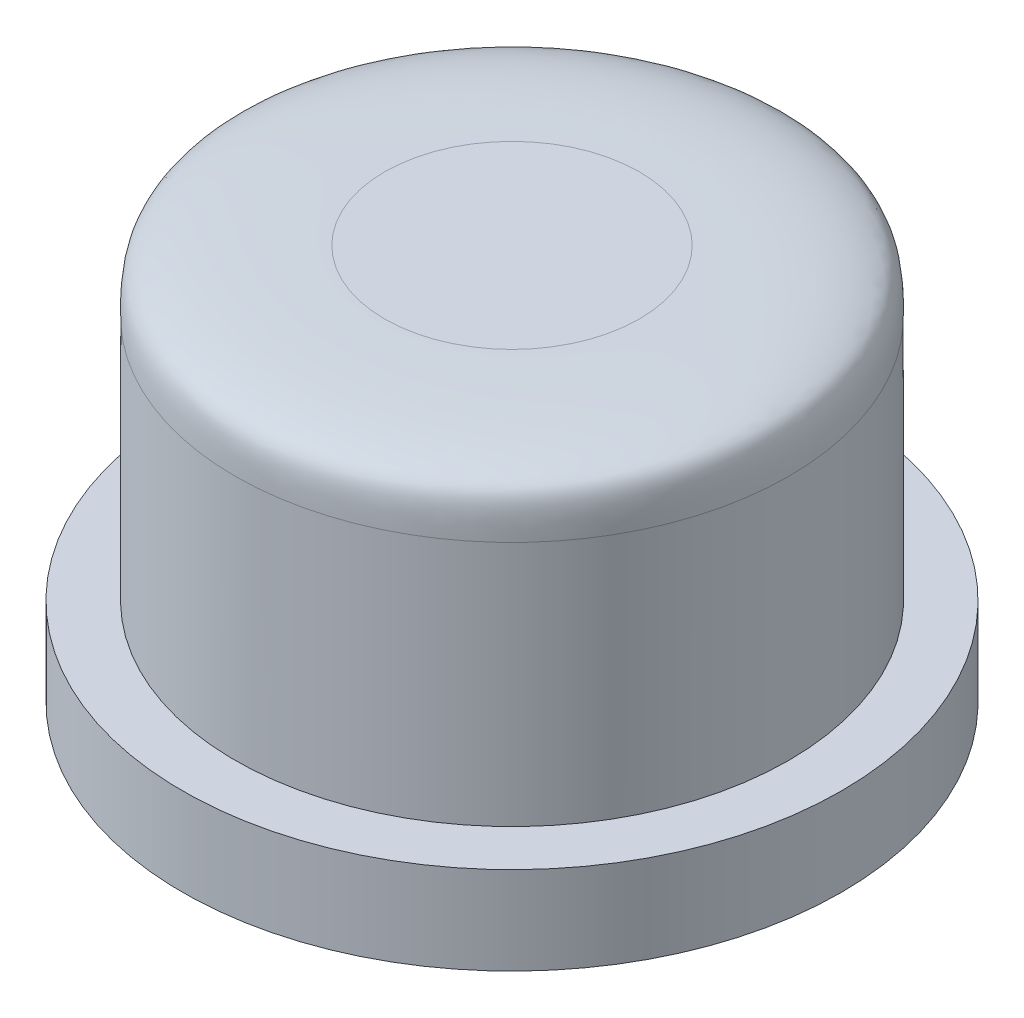
ISO-10303-21;
HEADER;
FILE_DESCRIPTION(('STEP AP214'),'2;1');
FILE_NAME('part.step','',(''),(''),'','','');
FILE_SCHEMA(('AUTOMOTIVE_DESIGN { 1 0 10303 214 1 1 1 1 }'));
ENDSEC;
DATA;
#1=APPLICATION_CONTEXT('core data for automotive mechanical design processes');
#2=APPLICATION_PROTOCOL_DEFINITION('international standard','automotive_design',2000,#1);
#3=PRODUCT_CONTEXT('',#1,'mechanical');
#4=PRODUCT('Part','Part','',(#3));
#5=PRODUCT_RELATED_PRODUCT_CATEGORY('part','',(#4));
#6=PRODUCT_DEFINITION_FORMATION('','',#4);
#7=PRODUCT_DEFINITION_CONTEXT('part definition',#1,'design');
#8=PRODUCT_DEFINITION('design','',#6,#7);
#9=PRODUCT_DEFINITION_SHAPE('','',#8);
#10=(LENGTH_UNIT() NAMED_UNIT(*) SI_UNIT(.MILLI.,.METRE.));
#11=(NAMED_UNIT(*) PLANE_ANGLE_UNIT() SI_UNIT($,.RADIAN.));
#12=(NAMED_UNIT(*) SI_UNIT($,.STERADIAN.) SOLID_ANGLE_UNIT());
#13=UNCERTAINTY_MEASURE_WITH_UNIT(LENGTH_MEASURE(1.E-05),#10,'distance_accuracy_value','');
#14=(GEOMETRIC_REPRESENTATION_CONTEXT(3) GLOBAL_UNCERTAINTY_ASSIGNED_CONTEXT((#13)) GLOBAL_UNIT_ASSIGNED_CONTEXT((#10,
#11,#12)) REPRESENTATION_CONTEXT('',''));
#15=CARTESIAN_POINT('',(0.,0.,0.));
#16=DIRECTION('',(0.,0.,1.));
#17=DIRECTION('',(1.,0.,0.));
#18=AXIS2_PLACEMENT_3D('',#15,#16,#17);
#19=CARTESIAN_POINT('',(3.75,0.,0.));
#20=DIRECTION('',(0.,-1.,0.));
#21=DIRECTION('',(1.,0.,0.));
#22=AXIS2_PLACEMENT_3D('',#19,#20,#21);
#23=PLANE('',#22);
#24=CARTESIAN_POINT('',(0.,0.,0.));
#25=DIRECTION('',(0.,-1.,0.));
#26=DIRECTION('',(1.,0.,0.));
#27=AXIS2_PLACEMENT_3D('',#24,#25,#26);
#28=CIRCLE('',#27,3.75);
#29=CARTESIAN_POINT('',(3.75,0.,0.));
#30=VERTEX_POINT('',#29);
#31=EDGE_CURVE('E60',#30,#30,#28,.T.);
#32=ORIENTED_EDGE('',*,*,#31,.T.);
#33=EDGE_LOOP('',(#32));
#34=FACE_BOUND('',#33,.T.);
#35=CARTESIAN_POINT('',(0.,0.,0.));
#36=DIRECTION('',(0.,-1.,0.));
#37=DIRECTION('',(1.,0.,0.));
#38=AXIS2_PLACEMENT_3D('',#35,#36,#37);
#39=CIRCLE('',#38,2.3);
#40=CARTESIAN_POINT('',(2.3,0.,0.));
#41=VERTEX_POINT('',#40);
#42=EDGE_CURVE('E10',#41,#41,#39,.T.);
#43=ORIENTED_EDGE('',*,*,#42,.F.);
#44=EDGE_LOOP('',(#43));
#45=FACE_BOUND('',#44,.T.);
#46=ADVANCED_FACE('F37',(#34,#45),#23,.T.);
#47=CARTESIAN_POINT('',(0.,0.9,0.));
#48=DIRECTION('',(0.,-1.,0.));
#49=DIRECTION('',(1.,0.,0.));
#50=AXIS2_PLACEMENT_3D('',#47,#48,#49);
#51=CYLINDRICAL_SURFACE('',#50,2.3);
#52=ORIENTED_EDGE('',*,*,#42,.T.);
#53=EDGE_LOOP('',(#52));
#54=FACE_BOUND('',#53,.T.);
#55=CARTESIAN_POINT('',(0.,0.899999999999999,0.));
#56=DIRECTION('',(0.,-1.,0.));
#57=DIRECTION('',(1.,0.,0.));
#58=AXIS2_PLACEMENT_3D('',#55,#56,#57);
#59=CIRCLE('',#58,2.3);
#60=CARTESIAN_POINT('',(2.3,0.9,0.));
#61=VERTEX_POINT('',#60);
#62=EDGE_CURVE('E44',#61,#61,#59,.T.);
#63=ORIENTED_EDGE('',*,*,#62,.F.);
#64=EDGE_LOOP('',(#63));
#65=FACE_BOUND('',#64,.T.);
#66=ADVANCED_FACE('F101',(#54,#65),#51,.F.);
#67=CARTESIAN_POINT('',(2.3,0.900000000000001,0.));
#68=DIRECTION('',(0.,-1.,0.));
#69=DIRECTION('',(1.,0.,0.));
#70=AXIS2_PLACEMENT_3D('',#67,#68,#69);
#71=PLANE('',#70);
#72=ORIENTED_EDGE('',*,*,#62,.T.);
#73=EDGE_LOOP('',(#72));
#74=FACE_BOUND('',#73,.T.);
#75=ADVANCED_FACE('F95',(#74),#71,.T.);
#76=CARTESIAN_POINT('',(0.,0.9,0.));
#77=DIRECTION('',(0.,-1.,0.));
#78=DIRECTION('',(1.,0.,0.));
#79=AXIS2_PLACEMENT_3D('',#76,#77,#78);
#80=CYLINDRICAL_SURFACE('',#79,3.15);
#81=CARTESIAN_POINT('',(0.,3.8,0.));
#82=DIRECTION('',(0.,1.,0.));
#83=DIRECTION('',(-1.,0.,0.));
#84=AXIS2_PLACEMENT_3D('',#81,#82,#83);
#85=CIRCLE('',#84,3.15);
#86=CARTESIAN_POINT('',(-3.15,3.8,0.));
#87=VERTEX_POINT('',#86);
#88=EDGE_CURVE('E64',#87,#87,#85,.T.);
#89=ORIENTED_EDGE('',*,*,#88,.F.);
#90=EDGE_LOOP('',(#89));
#91=FACE_BOUND('',#90,.T.);
#92=CARTESIAN_POINT('',(0.,0.999999999999999,0.));
#93=DIRECTION('',(0.,-1.,0.));
#94=DIRECTION('',(1.,0.,0.));
#95=AXIS2_PLACEMENT_3D('',#92,#93,#94);
#96=CIRCLE('',#95,3.15);
#97=CARTESIAN_POINT('',(3.15,1.,0.));
#98=VERTEX_POINT('',#97);
#99=EDGE_CURVE('E49',#98,#98,#96,.T.);
#100=ORIENTED_EDGE('',*,*,#99,.F.);
#101=EDGE_LOOP('',(#100));
#102=FACE_BOUND('',#101,.T.);
#103=ADVANCED_FACE('F91',(#91,#102),#80,.T.);
#104=CARTESIAN_POINT('',(3.15,1.,0.));
#105=DIRECTION('',(0.,1.,0.));
#106=DIRECTION('',(-1.,0.,0.));
#107=AXIS2_PLACEMENT_3D('',#104,#105,#106);
#108=PLANE('',#107);
#109=ORIENTED_EDGE('',*,*,#99,.T.);
#110=EDGE_LOOP('',(#109));
#111=FACE_BOUND('',#110,.T.);
#112=CARTESIAN_POINT('',(0.,0.999999999999998,0.));
#113=DIRECTION('',(0.,-1.,0.));
#114=DIRECTION('',(1.,0.,0.));
#115=AXIS2_PLACEMENT_3D('',#112,#113,#114);
#116=CIRCLE('',#115,3.75);
#117=CARTESIAN_POINT('',(3.75,1.,0.));
#118=VERTEX_POINT('',#117);
#119=EDGE_CURVE('E54',#118,#118,#116,.T.);
#120=ORIENTED_EDGE('',*,*,#119,.F.);
#121=EDGE_LOOP('',(#120));
#122=FACE_BOUND('',#121,.T.);
#123=ADVANCED_FACE('F87',(#111,#122),#108,.T.);
#124=CARTESIAN_POINT('',(0.,0.9,0.));
#125=DIRECTION('',(0.,-1.,0.));
#126=DIRECTION('',(1.,0.,0.));
#127=AXIS2_PLACEMENT_3D('',#124,#125,#126);
#128=CYLINDRICAL_SURFACE('',#127,3.75);
#129=ORIENTED_EDGE('',*,*,#119,.T.);
#130=EDGE_LOOP('',(#129));
#131=FACE_BOUND('',#130,.T.);
#132=ORIENTED_EDGE('',*,*,#31,.F.);
#133=EDGE_LOOP('',(#132));
#134=FACE_BOUND('',#133,.T.);
#135=ADVANCED_FACE('F83',(#131,#134),#128,.T.);
#136=CARTESIAN_POINT('',(1.45,4.5,0.));
#137=CARTESIAN_POINT('',(2.37361669515955,4.5,0.));
#138=CARTESIAN_POINT('',(2.76959027705304,4.43397779796872,0.));
#139=CARTESIAN_POINT('',(3.15320251714971,4.26764083273739,0.));
#140=CARTESIAN_POINT('',(3.15,4.02590321912702,0.));
#141=CARTESIAN_POINT('',(3.15,3.8,0.));
#142=B_SPLINE_CURVE_WITH_KNOTS('',3,(#136,#137,#138,#139,#140,#141),.UNSPECIFIED.,.F.,.F.,(4,1,
1,4),(0.,0.535445213404052,0.635445213404052,1.),.UNSPECIFIED.);
#143=CARTESIAN_POINT('',(0.,4.5,0.));
#144=DIRECTION('',(0.,1.,0.));
#145=AXIS1_PLACEMENT('',#143,#144);
#146=SURFACE_OF_REVOLUTION('',#142,#145);
#147=ORIENTED_EDGE('',*,*,#88,.T.);
#148=EDGE_LOOP('',(#147));
#149=FACE_BOUND('',#148,.T.);
#150=CARTESIAN_POINT('',(0.,4.5,0.));
#151=DIRECTION('',(0.,1.,0.));
#152=DIRECTION('',(-1.,0.,0.));
#153=AXIS2_PLACEMENT_3D('',#150,#151,#152);
#154=CIRCLE('',#153,1.45);
#155=CARTESIAN_POINT('',(-1.45,4.5,0.));
#156=VERTEX_POINT('',#155);
#157=EDGE_CURVE('E68',#156,#156,#154,.T.);
#158=ORIENTED_EDGE('',*,*,#157,.F.);
#159=EDGE_LOOP('',(#158));
#160=FACE_BOUND('',#159,.T.);
#161=ADVANCED_FACE('F79',(#149,#160),#146,.F.);
#162=CARTESIAN_POINT('',(0.,4.5,0.));
#163=DIRECTION('',(0.,1.,0.));
#164=DIRECTION('',(-1.,0.,0.));
#165=AXIS2_PLACEMENT_3D('',#162,#163,#164);
#166=PLANE('',#165);
#167=ORIENTED_EDGE('',*,*,#157,.T.);
#168=EDGE_LOOP('',(#167));
#169=FACE_BOUND('',#168,.T.);
#170=ADVANCED_FACE('F82',(#169),#166,.T.);
#171=CLOSED_SHELL('',(#46,#66,#75,#103,#123,#135,#161,#170));
#172=MANIFOLD_SOLID_BREP('B2',#171);
#173=ADVANCED_BREP_SHAPE_REPRESENTATION('',(#18,#172),#14);
#174=SHAPE_DEFINITION_REPRESENTATION(#9,#173);
ENDSEC;
END-ISO-10303-21;
